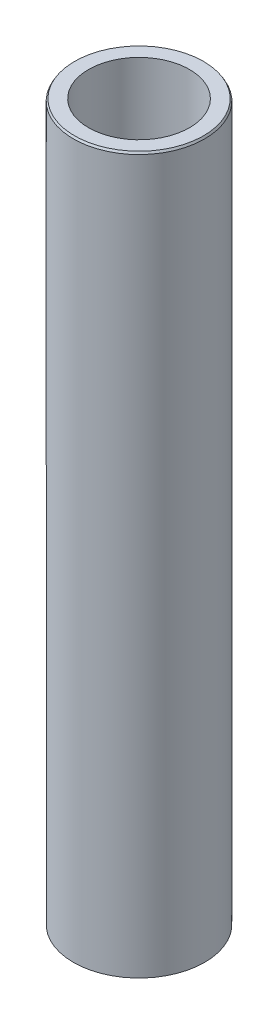
ISO-10303-21;
HEADER;
FILE_DESCRIPTION(('STEP AP214'),'2;1');
FILE_NAME('part.step','',(''),(''),'','','');
FILE_SCHEMA(('AUTOMOTIVE_DESIGN { 1 0 10303 214 1 1 1 1 }'));
ENDSEC;
DATA;
#1=APPLICATION_CONTEXT('core data for automotive mechanical design processes');
#2=APPLICATION_PROTOCOL_DEFINITION('international standard','automotive_design',2000,#1);
#3=PRODUCT_CONTEXT('',#1,'mechanical');
#4=PRODUCT('Part','Part','',(#3));
#5=PRODUCT_RELATED_PRODUCT_CATEGORY('part','',(#4));
#6=PRODUCT_DEFINITION_FORMATION('','',#4);
#7=PRODUCT_DEFINITION_CONTEXT('part definition',#1,'design');
#8=PRODUCT_DEFINITION('design','',#6,#7);
#9=PRODUCT_DEFINITION_SHAPE('','',#8);
#10=(LENGTH_UNIT() NAMED_UNIT(*) SI_UNIT(.MILLI.,.METRE.));
#11=(NAMED_UNIT(*) PLANE_ANGLE_UNIT() SI_UNIT($,.RADIAN.));
#12=(NAMED_UNIT(*) SI_UNIT($,.STERADIAN.) SOLID_ANGLE_UNIT());
#13=UNCERTAINTY_MEASURE_WITH_UNIT(LENGTH_MEASURE(1.E-05),#10,'distance_accuracy_value','');
#14=(GEOMETRIC_REPRESENTATION_CONTEXT(3) GLOBAL_UNCERTAINTY_ASSIGNED_CONTEXT((#13)) GLOBAL_UNIT_ASSIGNED_CONTEXT((#10,
#11,#12)) REPRESENTATION_CONTEXT('',''));
#15=CARTESIAN_POINT('',(0.,0.,0.));
#16=DIRECTION('',(0.,0.,1.));
#17=DIRECTION('',(1.,0.,0.));
#18=AXIS2_PLACEMENT_3D('',#15,#16,#17);
#19=CARTESIAN_POINT('',(0.,600.,0.));
#20=DIRECTION('',(0.,-1.,0.));
#21=DIRECTION('',(0.,0.,-1.));
#22=AXIS2_PLACEMENT_3D('',#19,#20,#21);
#23=CYLINDRICAL_SURFACE('',#22,55.);
#24=CARTESIAN_POINT('',(0.,598.272766797572,0.));
#25=DIRECTION('',(0.,1.,0.));
#26=DIRECTION('',(0.,0.,1.));
#27=AXIS2_PLACEMENT_3D('',#24,#25,#26);
#28=CIRCLE('',#27,55.);
#29=CARTESIAN_POINT('',(0.,598.272766797572,-55.));
#30=VERTEX_POINT('',#29);
#31=EDGE_CURVE('E50',#30,#30,#28,.F.);
#32=ORIENTED_EDGE('',*,*,#31,.T.);
#33=EDGE_LOOP('',(#32));
#34=FACE_BOUND('',#33,.T.);
#35=CARTESIAN_POINT('',(0.,0.997218554375068,0.));
#36=DIRECTION('',(0.,1.,0.));
#37=DIRECTION('',(0.,0.,1.));
#38=AXIS2_PLACEMENT_3D('',#35,#36,#37);
#39=CIRCLE('',#38,55.);
#40=CARTESIAN_POINT('',(0.,0.997218554375068,55.));
#41=VERTEX_POINT('',#40);
#42=EDGE_CURVE('E51',#41,#41,#39,.T.);
#43=ORIENTED_EDGE('',*,*,#42,.T.);
#44=EDGE_LOOP('',(#43));
#45=FACE_BOUND('',#44,.T.);
#46=ADVANCED_FACE('F39',(#34,#45),#23,.T.);
#47=CARTESIAN_POINT('',(0.,600.,0.));
#48=DIRECTION('',(0.,1.,0.));
#49=DIRECTION('',(0.,0.,1.));
#50=AXIS2_PLACEMENT_3D('',#47,#48,#49);
#51=PLANE('',#50);
#52=CARTESIAN_POINT('',(0.,600.,0.));
#53=DIRECTION('',(0.,1.,0.));
#54=DIRECTION('',(0.,0.,1.));
#55=AXIS2_PLACEMENT_3D('',#52,#53,#54);
#56=CIRCLE('',#55,54.0027814456249);
#57=CARTESIAN_POINT('',(0.,600.,-54.0027814456249));
#58=VERTEX_POINT('',#57);
#59=EDGE_CURVE('E54',#58,#58,#56,.T.);
#60=ORIENTED_EDGE('',*,*,#59,.T.);
#61=EDGE_LOOP('',(#60));
#62=FACE_BOUND('',#61,.T.);
#63=CARTESIAN_POINT('',(0.,600.,0.));
#64=DIRECTION('',(0.,1.,0.));
#65=DIRECTION('',(0.,0.,1.));
#66=AXIS2_PLACEMENT_3D('',#63,#64,#65);
#67=CIRCLE('',#66,42.2827795497861);
#68=CARTESIAN_POINT('',(0.,600.,42.2827795497861));
#69=VERTEX_POINT('',#68);
#70=EDGE_CURVE('E58',#69,#69,#67,.T.);
#71=ORIENTED_EDGE('',*,*,#70,.F.);
#72=EDGE_LOOP('',(#71));
#73=FACE_BOUND('',#72,.T.);
#74=ADVANCED_FACE('F69',(#62,#73),#51,.T.);
#75=CARTESIAN_POINT('',(0.,0.,0.));
#76=DIRECTION('',(0.,1.,0.));
#77=DIRECTION('',(0.,0.,1.));
#78=AXIS2_PLACEMENT_3D('',#75,#76,#77);
#79=PLANE('',#78);
#80=CARTESIAN_POINT('',(0.,0.,0.));
#81=DIRECTION('',(0.,1.,0.));
#82=DIRECTION('',(0.,0.,1.));
#83=AXIS2_PLACEMENT_3D('',#80,#81,#82);
#84=CIRCLE('',#83,53.2727667975719);
#85=CARTESIAN_POINT('',(0.,0.,53.2727667975719));
#86=VERTEX_POINT('',#85);
#87=EDGE_CURVE('E10',#86,#86,#84,.F.);
#88=ORIENTED_EDGE('',*,*,#87,.T.);
#89=EDGE_LOOP('',(#88));
#90=FACE_BOUND('',#89,.T.);
#91=CARTESIAN_POINT('',(0.,0.,0.));
#92=DIRECTION('',(0.,1.,0.));
#93=DIRECTION('',(0.,0.,1.));
#94=AXIS2_PLACEMENT_3D('',#91,#92,#93);
#95=CIRCLE('',#94,42.2827795497861);
#96=CARTESIAN_POINT('',(0.,0.,42.2827795497861));
#97=VERTEX_POINT('',#96);
#98=EDGE_CURVE('E63',#97,#97,#95,.T.);
#99=ORIENTED_EDGE('',*,*,#98,.T.);
#100=EDGE_LOOP('',(#99));
#101=FACE_BOUND('',#100,.T.);
#102=ADVANCED_FACE('F75',(#90,#101),#79,.F.);
#103=CARTESIAN_POINT('',(0.,600.,0.));
#104=DIRECTION('',(0.,-1.,0.));
#105=DIRECTION('',(0.,0.,-1.));
#106=AXIS2_PLACEMENT_3D('',#103,#104,#105);
#107=CYLINDRICAL_SURFACE('',#106,42.2827795497861);
#108=ORIENTED_EDGE('',*,*,#70,.T.);
#109=EDGE_LOOP('',(#108));
#110=FACE_BOUND('',#109,.T.);
#111=ORIENTED_EDGE('',*,*,#98,.F.);
#112=EDGE_LOOP('',(#111));
#113=FACE_BOUND('',#112,.T.);
#114=ADVANCED_FACE('F70',(#110,#113),#107,.F.);
#115=CARTESIAN_POINT('',(0.,600.,0.));
#116=DIRECTION('',(0.,-1.,0.));
#117=DIRECTION('',(0.,0.,-1.));
#118=AXIS2_PLACEMENT_3D('',#115,#116,#117);
#119=CONICAL_SURFACE('',#118,54.0027814456249,0.52359877559831);
#120=CARTESIAN_POINT('',(0.,598.272766797572,-55.));
#121=CARTESIAN_POINT('',(0.,598.290758810097,-54.9896123067253));
#122=CARTESIAN_POINT('',(0.,598.308750822622,-54.9792246134505));
#123=CARTESIAN_POINT('',(0.,598.344734847673,-54.9584492269011));
#124=CARTESIAN_POINT('',(0.,598.362726860198,-54.9480615336263));
#125=CARTESIAN_POINT('',(0.,598.398710885249,-54.9272861470768));
#126=CARTESIAN_POINT('',(0.,598.416702897774,-54.9168984538021));
#127=CARTESIAN_POINT('',(0.,598.452686922825,-54.8961230672526));
#128=CARTESIAN_POINT('',(0.,598.47067893535,-54.8857353739779));
#129=CARTESIAN_POINT('',(0.,598.506662960401,-54.8649599874284));
#130=CARTESIAN_POINT('',(0.,598.524654972926,-54.8545722941537));
#131=CARTESIAN_POINT('',(0.,598.560638997977,-54.8337969076042));
#132=CARTESIAN_POINT('',(0.,598.578631010502,-54.8234092143294));
#133=CARTESIAN_POINT('',(0.,598.614615035552,-54.8026338277799));
#134=CARTESIAN_POINT('',(0.,598.632607048078,-54.7922461345052));
#135=CARTESIAN_POINT('',(0.,598.668591073128,-54.7714707479557));
#136=CARTESIAN_POINT('',(0.,598.686583085654,-54.761083054681));
#137=CARTESIAN_POINT('',(0.,598.722567110704,-54.7403076681315));
#138=CARTESIAN_POINT('',(0.,598.740559123229,-54.7299199748568));
#139=CARTESIAN_POINT('',(0.,598.77654314828,-54.7091445883073));
#140=CARTESIAN_POINT('',(0.,598.794535160805,-54.6987568950326));
#141=CARTESIAN_POINT('',(0.,598.830519185856,-54.6779815084831));
#142=CARTESIAN_POINT('',(0.,598.848511198381,-54.6675938152083));
#143=CARTESIAN_POINT('',(0.,598.884495223432,-54.6468184286588));
#144=CARTESIAN_POINT('',(0.,598.902487235957,-54.6364307353841));
#145=CARTESIAN_POINT('',(0.,598.938471261008,-54.6156553488346));
#146=CARTESIAN_POINT('',(0.,598.956463273533,-54.6052676555599));
#147=CARTESIAN_POINT('',(0.,598.992447298584,-54.5844922690104));
#148=CARTESIAN_POINT('',(0.,599.010439311109,-54.5741045757357));
#149=CARTESIAN_POINT('',(0.,599.046423336159,-54.5533291891862));
#150=CARTESIAN_POINT('',(0.,599.064415348685,-54.5429414959114));
#151=CARTESIAN_POINT('',(0.,599.100399373735,-54.5221661093619));
#152=CARTESIAN_POINT('',(0.,599.118391386261,-54.5117784160872));
#153=CARTESIAN_POINT('',(0.,599.154375411311,-54.4910030295377));
#154=CARTESIAN_POINT('',(0.,599.172367423836,-54.480615336263));
#155=CARTESIAN_POINT('',(0.,599.208351448887,-54.4598399497135));
#156=CARTESIAN_POINT('',(0.,599.226343461412,-54.4494522564388));
#157=CARTESIAN_POINT('',(0.,599.262327486463,-54.4286768698893));
#158=CARTESIAN_POINT('',(0.,599.280319498988,-54.4182891766145));
#159=CARTESIAN_POINT('',(0.,599.316303524039,-54.397513790065));
#160=CARTESIAN_POINT('',(0.,599.334295536564,-54.3871260967903));
#161=CARTESIAN_POINT('',(0.,599.370279561615,-54.3663507102408));
#162=CARTESIAN_POINT('',(0.,599.38827157414,-54.3559630169661));
#163=CARTESIAN_POINT('',(0.,599.424255599191,-54.3351876304166));
#164=CARTESIAN_POINT('',(0.,599.442247611716,-54.3247999371419));
#165=CARTESIAN_POINT('',(0.,599.478231636766,-54.3040245505924));
#166=CARTESIAN_POINT('',(0.,599.496223649292,-54.2936368573177));
#167=CARTESIAN_POINT('',(0.,599.532207674342,-54.2728614707682));
#168=CARTESIAN_POINT('',(0.,599.550199686868,-54.2624737774934));
#169=CARTESIAN_POINT('',(0.,599.586183711918,-54.2416983909439));
#170=CARTESIAN_POINT('',(0.,599.604175724444,-54.2313106976692));
#171=CARTESIAN_POINT('',(0.,599.640159749494,-54.2105353111197));
#172=CARTESIAN_POINT('',(0.,599.658151762019,-54.200147617845));
#173=CARTESIAN_POINT('',(0.,599.69413578707,-54.1793722312955));
#174=CARTESIAN_POINT('',(0.,599.712127799595,-54.1689845380208));
#175=CARTESIAN_POINT('',(0.,599.748111824646,-54.1482091514713));
#176=CARTESIAN_POINT('',(0.,599.766103837171,-54.1378214581965));
#177=CARTESIAN_POINT('',(0.,599.802087862222,-54.1170460716471));
#178=CARTESIAN_POINT('',(0.,599.820079874747,-54.1066583783723));
#179=CARTESIAN_POINT('',(0.,599.856063899798,-54.0858829918228));
#180=CARTESIAN_POINT('',(0.,599.874055912323,-54.0754952985481));
#181=CARTESIAN_POINT('',(0.,599.910039937373,-54.0547199119986));
#182=CARTESIAN_POINT('',(0.,599.928031949899,-54.0443322187239));
#183=CARTESIAN_POINT('',(0.,599.964015974949,-54.0235568321744));
#184=CARTESIAN_POINT('',(0.,599.982007987475,-54.0131691388996));
#185=CARTESIAN_POINT('',(0.,600.,-54.0027814456249));
#186=B_SPLINE_CURVE_WITH_KNOTS('',3,(#120,#121,#122,#123,#124,#125,#126,#127,#128,#129,#130,
#131,#132,#133,#134,#135,#136,#137,#138,#139,#140,#141,#142,#143,#144,#145,#146,#147,#148,#149,
#150,#151,#152,#153,#154,#155,#156,#157,#158,#159,#160,#161,#162,#163,#164,#165,#166,#167,#168,
#169,#170,#171,#172,#173,#174,#175,#176,#177,#178,#179,#180,#181,#182,#183,#184,#185),
.UNSPECIFIED.,.F.,.F.,(4,2,2,2,2,2,2,2,2,2,2,2,2,2,2,2,2,2,2,2,2,2,2,2,2,2,2,2,2,2,2,2,4),(0.,
0.0623261596484152,0.12465231929683,0.186978478945246,0.249304638593757,0.311630798242169,
0.373956957890584,0.436283117539095,0.49860927718751,0.560935436835922,0.623261596484433,
0.685587756132849,0.747913915781264,0.810240075429775,0.872566235078187,0.934892394726602,
0.997218554375113,1.05954471402353,1.12187087367194,1.18419703332036,1.24652319296887,
1.30884935261728,1.3711755122657,1.4335016719142,1.49582783156262,1.55815399121104,
1.62048015085955,1.68280631050796,1.74513247015637,1.80745862980488,1.8697847894533,
1.93211094910171,1.99443710875022),.UNSPECIFIED.);
#187=EDGE_CURVE('BSEAM81',#30,#58,#186,.T.);
#188=ORIENTED_EDGE('',*,*,#31,.F.);
#189=ORIENTED_EDGE('',*,*,#59,.F.);
#190=ORIENTED_EDGE('',*,*,#187,.T.);
#191=ORIENTED_EDGE('',*,*,#187,.F.);
#192=EDGE_LOOP('',(#188,#190,#189,#191));
#193=FACE_BOUND('',#192,.T.);
#194=ADVANCED_FACE('F81',(#193),#119,.T.);
#195=CARTESIAN_POINT('',(0.,0.997218554375068,0.));
#196=DIRECTION('',(0.,1.,0.));
#197=DIRECTION('',(0.,0.,1.));
#198=AXIS2_PLACEMENT_3D('',#195,#196,#197);
#199=CONICAL_SURFACE('',#198,55.,1.04719755119662);
#200=ORIENTED_EDGE('',*,*,#87,.F.);
#201=EDGE_LOOP('',(#200));
#202=FACE_BOUND('',#201,.T.);
#203=ORIENTED_EDGE('',*,*,#42,.F.);
#204=EDGE_LOOP('',(#203));
#205=FACE_BOUND('',#204,.T.);
#206=ADVANCED_FACE('F45',(#202,#205),#199,.T.);
#207=CLOSED_SHELL('',(#46,#74,#102,#114,#194,#206));
#208=MANIFOLD_SOLID_BREP('B2',#207);
#209=ADVANCED_BREP_SHAPE_REPRESENTATION('',(#18,#208),#14);
#210=SHAPE_DEFINITION_REPRESENTATION(#9,#209);
ENDSEC;
END-ISO-10303-21;
